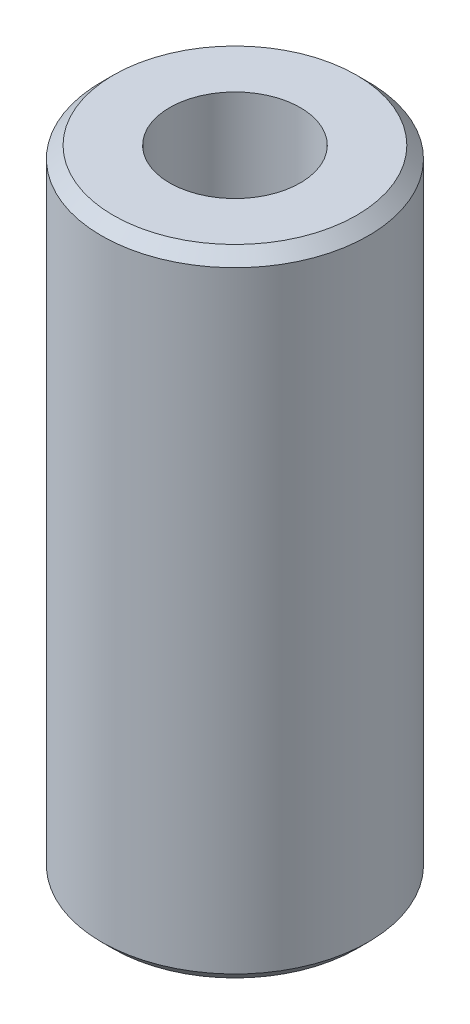
ISO-10303-21;
HEADER;
FILE_DESCRIPTION(('STEP AP214'),'2;1');
FILE_NAME('part.step','',(''),(''),'','','');
FILE_SCHEMA(('AUTOMOTIVE_DESIGN { 1 0 10303 214 1 1 1 1 }'));
ENDSEC;
DATA;
#1=APPLICATION_CONTEXT('core data for automotive mechanical design processes');
#2=APPLICATION_PROTOCOL_DEFINITION('international standard','automotive_design',2000,#1);
#3=PRODUCT_CONTEXT('',#1,'mechanical');
#4=PRODUCT('Part','Part','',(#3));
#5=PRODUCT_RELATED_PRODUCT_CATEGORY('part','',(#4));
#6=PRODUCT_DEFINITION_FORMATION('','',#4);
#7=PRODUCT_DEFINITION_CONTEXT('part definition',#1,'design');
#8=PRODUCT_DEFINITION('design','',#6,#7);
#9=PRODUCT_DEFINITION_SHAPE('','',#8);
#10=(LENGTH_UNIT() NAMED_UNIT(*) SI_UNIT(.MILLI.,.METRE.));
#11=(NAMED_UNIT(*) PLANE_ANGLE_UNIT() SI_UNIT($,.RADIAN.));
#12=(NAMED_UNIT(*) SI_UNIT($,.STERADIAN.) SOLID_ANGLE_UNIT());
#13=UNCERTAINTY_MEASURE_WITH_UNIT(LENGTH_MEASURE(1.E-05),#10,'distance_accuracy_value','');
#14=(GEOMETRIC_REPRESENTATION_CONTEXT(3) GLOBAL_UNCERTAINTY_ASSIGNED_CONTEXT((#13)) GLOBAL_UNIT_ASSIGNED_CONTEXT((#10,
#11,#12)) REPRESENTATION_CONTEXT('',''));
#15=CARTESIAN_POINT('',(0.,0.,0.));
#16=DIRECTION('',(0.,0.,1.));
#17=DIRECTION('',(1.,0.,0.));
#18=AXIS2_PLACEMENT_3D('',#15,#16,#17);
#19=CARTESIAN_POINT('',(0.,214.367668514871,0.));
#20=DIRECTION('',(0.,-1.,0.));
#21=DIRECTION('',(0.,0.,-1.));
#22=AXIS2_PLACEMENT_3D('',#19,#20,#21);
#23=CYLINDRICAL_SURFACE('',#22,45.);
#24=CARTESIAN_POINT('',(0.,210.39208648252,0.));
#25=DIRECTION('',(0.,1.,0.));
#26=DIRECTION('',(0.,0.,1.));
#27=AXIS2_PLACEMENT_3D('',#24,#25,#26);
#28=CIRCLE('',#27,45.);
#29=CARTESIAN_POINT('',(0.,210.39208648252,45.));
#30=VERTEX_POINT('',#29);
#31=EDGE_CURVE('E50',#30,#30,#28,.F.);
#32=ORIENTED_EDGE('',*,*,#31,.T.);
#33=EDGE_LOOP('',(#32));
#34=FACE_BOUND('',#33,.T.);
#35=CARTESIAN_POINT('',(0.,3.9755820323511,0.));
#36=DIRECTION('',(0.,1.,0.));
#37=DIRECTION('',(0.,0.,1.));
#38=AXIS2_PLACEMENT_3D('',#35,#36,#37);
#39=CIRCLE('',#38,45.);
#40=CARTESIAN_POINT('',(0.,3.9755820323511,45.));
#41=VERTEX_POINT('',#40);
#42=EDGE_CURVE('E51',#41,#41,#39,.T.);
#43=ORIENTED_EDGE('',*,*,#42,.T.);
#44=EDGE_LOOP('',(#43));
#45=FACE_BOUND('',#44,.T.);
#46=ADVANCED_FACE('F39',(#34,#45),#23,.T.);
#47=CARTESIAN_POINT('',(0.,214.367668514871,0.));
#48=DIRECTION('',(0.,1.,0.));
#49=DIRECTION('',(0.,0.,1.));
#50=AXIS2_PLACEMENT_3D('',#47,#48,#49);
#51=PLANE('',#50);
#52=CARTESIAN_POINT('',(0.,214.367668514871,0.));
#53=DIRECTION('',(0.,1.,0.));
#54=DIRECTION('',(0.,0.,1.));
#55=AXIS2_PLACEMENT_3D('',#52,#53,#54);
#56=CIRCLE('',#55,41.0244179676489);
#57=CARTESIAN_POINT('',(0.,214.367668514871,41.0244179676489));
#58=VERTEX_POINT('',#57);
#59=EDGE_CURVE('E54',#58,#58,#56,.T.);
#60=ORIENTED_EDGE('',*,*,#59,.T.);
#61=EDGE_LOOP('',(#60));
#62=FACE_BOUND('',#61,.T.);
#63=CARTESIAN_POINT('',(0.,214.367668514871,0.));
#64=DIRECTION('',(0.,1.,0.));
#65=DIRECTION('',(0.,0.,1.));
#66=AXIS2_PLACEMENT_3D('',#63,#64,#65);
#67=CIRCLE('',#66,22.0454123243271);
#68=CARTESIAN_POINT('',(0.,214.367668514871,22.0454123243271));
#69=VERTEX_POINT('',#68);
#70=EDGE_CURVE('E58',#69,#69,#67,.T.);
#71=ORIENTED_EDGE('',*,*,#70,.F.);
#72=EDGE_LOOP('',(#71));
#73=FACE_BOUND('',#72,.T.);
#74=ADVANCED_FACE('F69',(#62,#73),#51,.T.);
#75=CARTESIAN_POINT('',(0.,0.,0.));
#76=DIRECTION('',(0.,1.,0.));
#77=DIRECTION('',(0.,0.,1.));
#78=AXIS2_PLACEMENT_3D('',#75,#76,#77);
#79=PLANE('',#78);
#80=CARTESIAN_POINT('',(0.,0.,0.));
#81=DIRECTION('',(0.,1.,0.));
#82=DIRECTION('',(0.,0.,1.));
#83=AXIS2_PLACEMENT_3D('',#80,#81,#82);
#84=CIRCLE('',#83,41.0244179676489);
#85=CARTESIAN_POINT('',(0.,0.,41.0244179676489));
#86=VERTEX_POINT('',#85);
#87=EDGE_CURVE('E10',#86,#86,#84,.F.);
#88=ORIENTED_EDGE('',*,*,#87,.T.);
#89=EDGE_LOOP('',(#88));
#90=FACE_BOUND('',#89,.T.);
#91=CARTESIAN_POINT('',(0.,0.,0.));
#92=DIRECTION('',(0.,1.,0.));
#93=DIRECTION('',(0.,0.,1.));
#94=AXIS2_PLACEMENT_3D('',#91,#92,#93);
#95=CIRCLE('',#94,22.0454123243271);
#96=CARTESIAN_POINT('',(0.,0.,22.0454123243271));
#97=VERTEX_POINT('',#96);
#98=EDGE_CURVE('E63',#97,#97,#95,.T.);
#99=ORIENTED_EDGE('',*,*,#98,.T.);
#100=EDGE_LOOP('',(#99));
#101=FACE_BOUND('',#100,.T.);
#102=ADVANCED_FACE('F75',(#90,#101),#79,.F.);
#103=CARTESIAN_POINT('',(0.,214.367668514871,0.));
#104=DIRECTION('',(0.,-1.,0.));
#105=DIRECTION('',(0.,0.,-1.));
#106=AXIS2_PLACEMENT_3D('',#103,#104,#105);
#107=CYLINDRICAL_SURFACE('',#106,22.0454123243271);
#108=ORIENTED_EDGE('',*,*,#70,.T.);
#109=EDGE_LOOP('',(#108));
#110=FACE_BOUND('',#109,.T.);
#111=ORIENTED_EDGE('',*,*,#98,.F.);
#112=EDGE_LOOP('',(#111));
#113=FACE_BOUND('',#112,.T.);
#114=ADVANCED_FACE('F70',(#110,#113),#107,.F.);
#115=CARTESIAN_POINT('',(0.,214.367668514871,0.));
#116=DIRECTION('',(0.,-1.,0.));
#117=DIRECTION('',(0.,0.,-1.));
#118=AXIS2_PLACEMENT_3D('',#115,#116,#117);
#119=CONICAL_SURFACE('',#118,41.0244179676489,0.785398163397441);
#120=ORIENTED_EDGE('',*,*,#31,.F.);
#121=EDGE_LOOP('',(#120));
#122=FACE_BOUND('',#121,.T.);
#123=ORIENTED_EDGE('',*,*,#59,.F.);
#124=EDGE_LOOP('',(#123));
#125=FACE_BOUND('',#124,.T.);
#126=ADVANCED_FACE('F81',(#122,#125),#119,.T.);
#127=CARTESIAN_POINT('',(0.,3.9755820323511,0.));
#128=DIRECTION('',(0.,1.,0.));
#129=DIRECTION('',(0.,0.,1.));
#130=AXIS2_PLACEMENT_3D('',#127,#128,#129);
#131=CONICAL_SURFACE('',#130,45.,0.785398163397448);
#132=ORIENTED_EDGE('',*,*,#87,.F.);
#133=EDGE_LOOP('',(#132));
#134=FACE_BOUND('',#133,.T.);
#135=ORIENTED_EDGE('',*,*,#42,.F.);
#136=EDGE_LOOP('',(#135));
#137=FACE_BOUND('',#136,.T.);
#138=ADVANCED_FACE('F45',(#134,#137),#131,.T.);
#139=CLOSED_SHELL('',(#46,#74,#102,#114,#126,#138));
#140=MANIFOLD_SOLID_BREP('B2',#139);
#141=ADVANCED_BREP_SHAPE_REPRESENTATION('',(#18,#140),#14);
#142=SHAPE_DEFINITION_REPRESENTATION(#9,#141);
ENDSEC;
END-ISO-10303-21;
